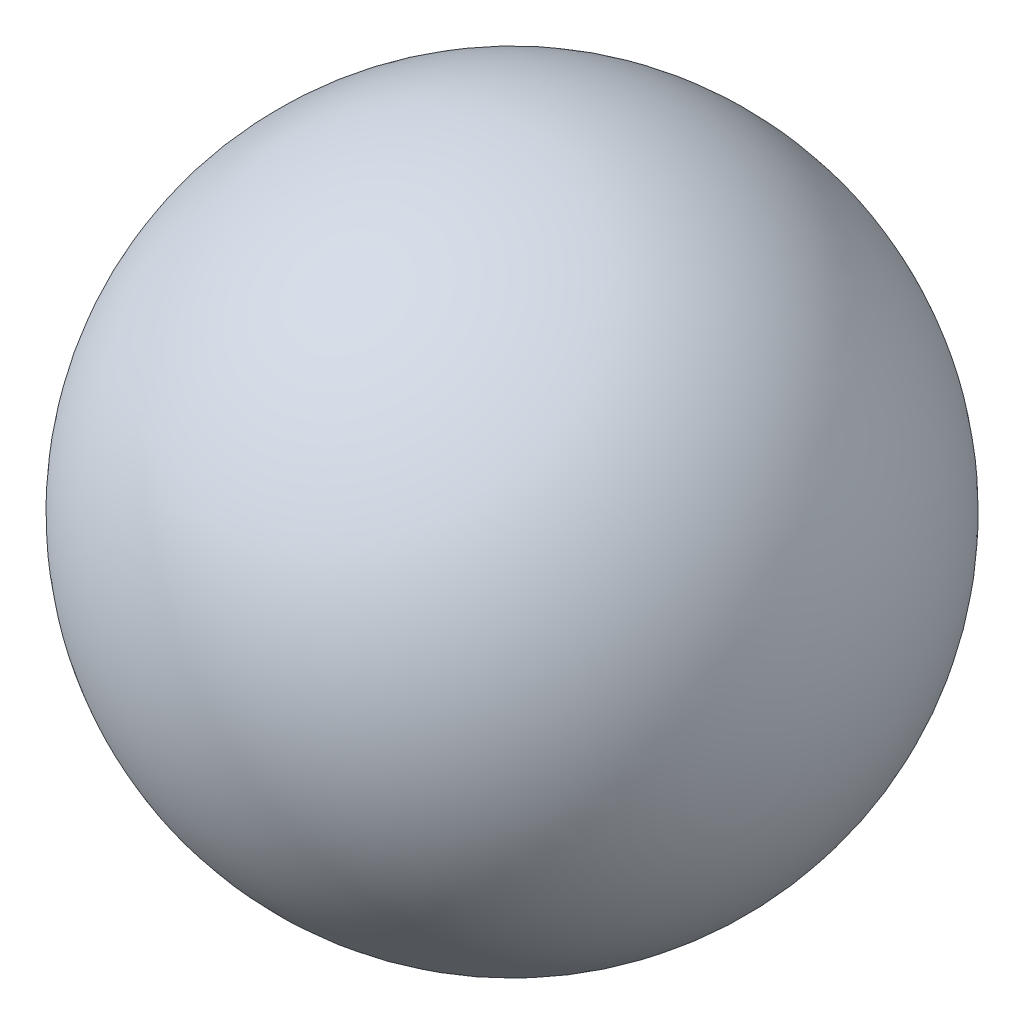
ISO-10303-21;
HEADER;
FILE_DESCRIPTION(('STEP AP214'),'2;1');
FILE_NAME('part.step','',(''),(''),'','','');
FILE_SCHEMA(('AUTOMOTIVE_DESIGN { 1 0 10303 214 1 1 1 1 }'));
ENDSEC;
DATA;
#1=APPLICATION_CONTEXT('core data for automotive mechanical design processes');
#2=APPLICATION_PROTOCOL_DEFINITION('international standard','automotive_design',2000,#1);
#3=PRODUCT_CONTEXT('',#1,'mechanical');
#4=PRODUCT('Part','Part','',(#3));
#5=PRODUCT_RELATED_PRODUCT_CATEGORY('part','',(#4));
#6=PRODUCT_DEFINITION_FORMATION('','',#4);
#7=PRODUCT_DEFINITION_CONTEXT('part definition',#1,'design');
#8=PRODUCT_DEFINITION('design','',#6,#7);
#9=PRODUCT_DEFINITION_SHAPE('','',#8);
#10=(LENGTH_UNIT() NAMED_UNIT(*) SI_UNIT(.MILLI.,.METRE.));
#11=(NAMED_UNIT(*) PLANE_ANGLE_UNIT() SI_UNIT($,.RADIAN.));
#12=(NAMED_UNIT(*) SI_UNIT($,.STERADIAN.) SOLID_ANGLE_UNIT());
#13=UNCERTAINTY_MEASURE_WITH_UNIT(LENGTH_MEASURE(1.E-05),#10,'distance_accuracy_value','');
#14=(GEOMETRIC_REPRESENTATION_CONTEXT(3) GLOBAL_UNCERTAINTY_ASSIGNED_CONTEXT((#13)) GLOBAL_UNIT_ASSIGNED_CONTEXT((#10,
#11,#12)) REPRESENTATION_CONTEXT('',''));
#15=CARTESIAN_POINT('',(0.,0.,0.));
#16=DIRECTION('',(0.,0.,1.));
#17=DIRECTION('',(1.,0.,0.));
#18=AXIS2_PLACEMENT_3D('',#15,#16,#17);
#19=CARTESIAN_POINT('',(0.,0.,0.));
#20=DIRECTION('',(0.,0.,-1.));
#21=DIRECTION('',(0.,-1.,0.));
#22=AXIS2_PLACEMENT_3D('',#19,#20,#21);
#23=SPHERICAL_SURFACE('',#22,9.525);
#24=CARTESIAN_POINT('',(0.,0.,-9.525));
#25=VERTEX_POINT('',#24);
#26=VERTEX_LOOP('',#25);
#27=FACE_BOUND('',#26,.T.);
#28=ADVANCED_FACE('F35',(#27),#23,.T.);
#29=CLOSED_SHELL('',(#28));
#30=MANIFOLD_SOLID_BREP('B2',#29);
#31=ADVANCED_BREP_SHAPE_REPRESENTATION('',(#18,#30),#14);
#32=SHAPE_DEFINITION_REPRESENTATION(#9,#31);
ENDSEC;
END-ISO-10303-21;
